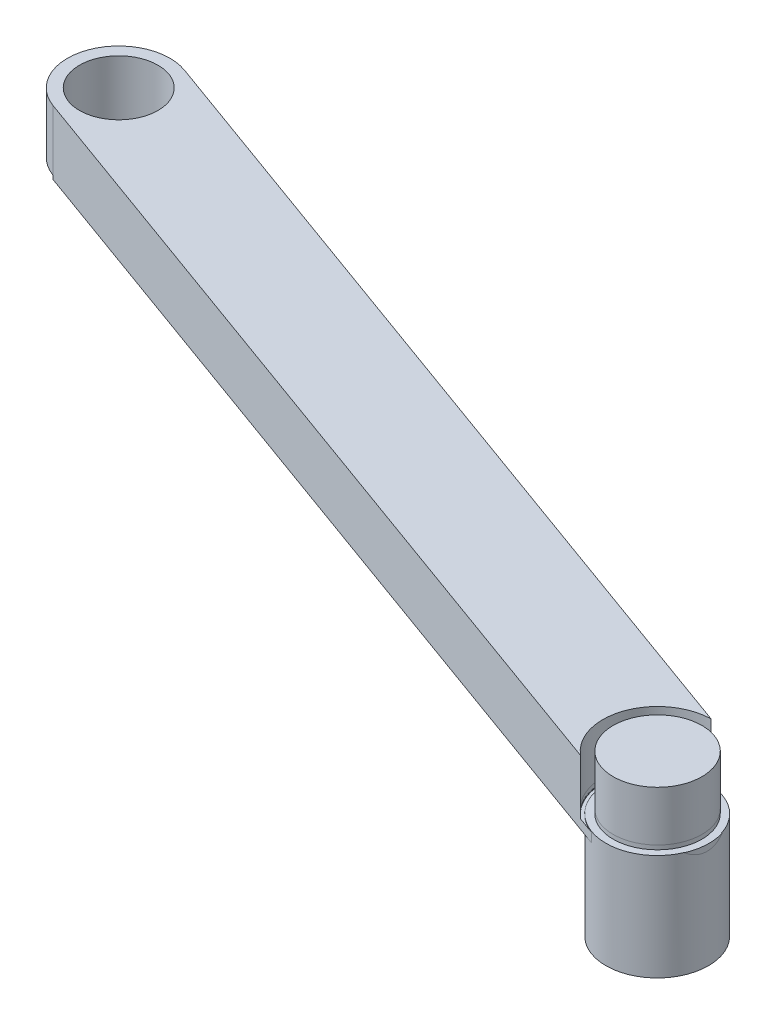
ISO-10303-21;
HEADER;
FILE_DESCRIPTION(('STEP AP214'),'2;1');
FILE_NAME('part.step','',(''),(''),'','','');
FILE_SCHEMA(('AUTOMOTIVE_DESIGN { 1 0 10303 214 1 1 1 1 }'));
ENDSEC;
DATA;
#1=APPLICATION_CONTEXT('core data for automotive mechanical design processes');
#2=APPLICATION_PROTOCOL_DEFINITION('international standard','automotive_design',2000,#1);
#3=PRODUCT_CONTEXT('',#1,'mechanical');
#4=PRODUCT('Part','Part','',(#3));
#5=PRODUCT_RELATED_PRODUCT_CATEGORY('part','',(#4));
#6=PRODUCT_DEFINITION_FORMATION('','',#4);
#7=PRODUCT_DEFINITION_CONTEXT('part definition',#1,'design');
#8=PRODUCT_DEFINITION('design','',#6,#7);
#9=PRODUCT_DEFINITION_SHAPE('','',#8);
#10=(LENGTH_UNIT() NAMED_UNIT(*) SI_UNIT(.MILLI.,.METRE.));
#11=(NAMED_UNIT(*) PLANE_ANGLE_UNIT() SI_UNIT($,.RADIAN.));
#12=(NAMED_UNIT(*) SI_UNIT($,.STERADIAN.) SOLID_ANGLE_UNIT());
#13=UNCERTAINTY_MEASURE_WITH_UNIT(LENGTH_MEASURE(1.E-05),#10,'distance_accuracy_value','');
#14=(GEOMETRIC_REPRESENTATION_CONTEXT(3) GLOBAL_UNCERTAINTY_ASSIGNED_CONTEXT((#13)) GLOBAL_UNIT_ASSIGNED_CONTEXT((#10,
#11,#12)) REPRESENTATION_CONTEXT('',''));
#15=CARTESIAN_POINT('',(0.,0.,0.));
#16=DIRECTION('',(0.,0.,1.));
#17=DIRECTION('',(1.,0.,0.));
#18=AXIS2_PLACEMENT_3D('',#15,#16,#17);
#19=CARTESIAN_POINT('',(85.8457251195717,56.3914355366213,55.1664235793516));
#20=DIRECTION('',(0.,-1.,0.));
#21=DIRECTION('',(0.0808490214511132,0.,-0.996726359504151));
#22=AXIS2_PLACEMENT_3D('',#19,#20,#21);
#23=CYLINDRICAL_SURFACE('',#22,3.46216045673487);
#24=CARTESIAN_POINT('',(85.8457251195717,52.7714355366213,55.1664235793516));
#25=DIRECTION('',(0.,1.,0.));
#26=DIRECTION('',(-0.0808490214511134,0.,0.996726359504151));
#27=AXIS2_PLACEMENT_3D('',#24,#25,#26);
#28=CIRCLE('',#27,3.46216045673486);
#29=CARTESIAN_POINT('',(85.5658128345379,52.7714355366213,58.6172501674122));
#30=VERTEX_POINT('',#29);
#31=EDGE_CURVE('E175',#30,#30,#28,.T.);
#32=ORIENTED_EDGE('',*,*,#31,.T.);
#33=EDGE_LOOP('',(#32));
#34=FACE_BOUND('',#33,.T.);
#35=CARTESIAN_POINT('',(85.8457251195717,56.6741982646804,55.1664235793516));
#36=DIRECTION('',(0.,1.,0.));
#37=DIRECTION('',(-1.,0.,0.));
#38=AXIS2_PLACEMENT_3D('',#35,#36,#37);
#39=CIRCLE('',#38,3.46216045673485);
#40=CARTESIAN_POINT('',(82.3835646628368,56.6741982646804,55.1664235793516));
#41=VERTEX_POINT('',#40);
#42=EDGE_CURVE('E337',#41,#41,#39,.T.);
#43=ORIENTED_EDGE('',*,*,#42,.F.);
#44=EDGE_LOOP('',(#43));
#45=FACE_BOUND('',#44,.T.);
#46=ADVANCED_FACE('F47',(#34,#45),#23,.T.);
#47=CARTESIAN_POINT('',(-3.49498099406498,44.1741982646804,22.8672179713954));
#48=DIRECTION('',(0.,1.,0.));
#49=DIRECTION('',(0.940352368567653,0.,0.340202032517745));
#50=AXIS2_PLACEMENT_3D('',#47,#48,#49);
#51=PLANE('',#50);
#52=CARTESIAN_POINT('',(85.8384940198621,44.1741982646804,55.1864110605812));
#53=DIRECTION('',(0.,1.,0.));
#54=DIRECTION('',(0.940352368567653,0.,0.340202032517745));
#55=AXIS2_PLACEMENT_3D('',#52,#53,#54);
#56=CIRCLE('',#55,4.);
#57=CARTESIAN_POINT('',(89.5999034941327,44.1741982646804,56.5472191906522));
#58=VERTEX_POINT('',#57);
#59=EDGE_CURVE('E411',#58,#58,#56,.T.);
#60=ORIENTED_EDGE('',*,*,#59,.F.);
#61=EDGE_LOOP('',(#60));
#62=FACE_BOUND('',#61,.T.);
#63=ADVANCED_FACE('F238',(#62),#51,.F.);
#64=CARTESIAN_POINT('',(85.8451387170718,57.4541363944661,55.1680444543817));
#65=DIRECTION('',(0.,1.,0.));
#66=DIRECTION('',(-0.0808490214511132,0.,0.996726359504151));
#67=AXIS2_PLACEMENT_3D('',#64,#65,#66);
#68=CYLINDRICAL_SURFACE('',#67,3.46388414573083);
#69=ORIENTED_EDGE('',*,*,#31,.F.);
#70=EDGE_LOOP('',(#69));
#71=FACE_BOUND('',#70,.T.);
#72=CARTESIAN_POINT('',(85.8451387170718,52.4498767005646,55.1680444543817));
#73=DIRECTION('',(0.,1.,0.));
#74=DIRECTION('',(-0.0808490214511132,0.,0.996726359504151));
#75=AXIS2_PLACEMENT_3D('',#72,#73,#74);
#76=CIRCLE('',#75,3.46388414573083);
#77=CARTESIAN_POINT('',(85.5650870734694,52.4498767005646,58.6205890887001));
#78=VERTEX_POINT('',#77);
#79=EDGE_CURVE('E164',#78,#78,#76,.T.);
#80=ORIENTED_EDGE('',*,*,#79,.T.);
#81=EDGE_LOOP('',(#80));
#82=FACE_BOUND('',#81,.T.);
#83=ADVANCED_FACE('F270',(#71,#82),#68,.T.);
#84=CARTESIAN_POINT('',(85.8451387170718,57.4541363944661,55.1680444543817));
#85=DIRECTION('',(0.,-1.,0.));
#86=DIRECTION('',(0.0808490214511132,0.,-0.996726359504151));
#87=AXIS2_PLACEMENT_3D('',#84,#85,#86);
#88=CYLINDRICAL_SURFACE('',#87,4.01953162113846);
#89=CARTESIAN_POINT('',(89.3687623921373,52.7701991631344,57.1021361403806));
#90=CARTESIAN_POINT('',(89.3908972797413,52.7221278434932,57.0618099325423));
#91=CARTESIAN_POINT('',(89.4132007691247,52.675809604025,57.0195330596799));
#92=CARTESIAN_POINT('',(89.4576859180895,52.5868622370854,56.9311635140443));
#93=CARTESIAN_POINT('',(89.4798675215307,52.54423469469,56.885069218234));
#94=CARTESIAN_POINT('',(89.545709618222,52.4218539904194,56.7408087204941));
#95=CARTESIAN_POINT('',(89.5884583328156,52.3480421194022,56.637031994895));
#96=CARTESIAN_POINT('',(89.6678090984182,52.2184792637632,56.416101875649));
#97=CARTESIAN_POINT('',(89.7043903916411,52.162788707717,56.2989054528141));
#98=CARTESIAN_POINT('',(89.7677313215756,52.0723734133498,56.0544682306541));
#99=CARTESIAN_POINT('',(89.7945180599111,52.0375906483577,55.9272563495601));
#100=CARTESIAN_POINT('',(89.8339290494133,51.9928439154911,55.6785323546795));
#101=CARTESIAN_POINT('',(89.8476113800621,51.9809271454762,55.5575384668752));
#102=CARTESIAN_POINT('',(89.8638501867552,51.9764334949343,55.3144076220675));
#103=CARTESIAN_POINT('',(89.8664046907054,51.9838600420932,55.1922704662953));
#104=CARTESIAN_POINT('',(89.8608264297183,52.016302765115,54.9594787300138));
#105=CARTESIAN_POINT('',(89.8534353082014,52.0400403586655,54.8486221742364));
#106=CARTESIAN_POINT('',(89.8302781322698,52.1025862904,54.6321781108256));
#107=CARTESIAN_POINT('',(89.8145098563547,52.1413986254534,54.5265920089693));
#108=CARTESIAN_POINT('',(89.7750126083237,52.2353934426093,54.316678578976));
#109=CARTESIAN_POINT('',(89.7508592583065,52.2914251653037,54.2128149725876));
#110=CARTESIAN_POINT('',(89.6971743724085,52.4170746399693,54.0152519701816));
#111=CARTESIAN_POINT('',(89.6676445795716,52.4866879892959,53.9215492956513));
#112=CARTESIAN_POINT('',(89.6234078729869,52.5948214358763,53.7958455509132));
#113=CARTESIAN_POINT('',(89.6098455165828,52.6284489267671,53.7591170535012));
#114=CARTESIAN_POINT('',(89.5824381533573,52.6977759093591,53.6879512136356));
#115=CARTESIAN_POINT('',(89.5685938330373,52.7334706862004,53.6535090144503));
#116=CARTESIAN_POINT('',(89.5546964119901,52.7701991631344,53.6202020330079));
#117=B_SPLINE_CURVE_WITH_KNOTS('',3,(#89,#90,#91,#92,#93,#94,#95,#96,#97,#98,#99,#100,#101,#102,
#103,#104,#105,#106,#107,#108,#109,#110,#111,#112,#113,#114,#115,#116),.UNSPECIFIED.,.F.,.F.,(4,
2,2,2,2,2,2,2,2,2,2,2,2,4),(0.,0.199496474361152,0.399078207551672,0.800049133333822,
1.20234377852682,1.60351669281897,1.96856565127002,2.33367930174428,2.67302106211816,
3.01245285597977,3.37244672636313,3.73232409379486,3.88708342006848,4.04150271496432),.UNSPECIFIED.);
#118=CARTESIAN_POINT('',(89.5310775562295,52.4498767005646,56.7713190183042));
#119=VERTEX_POINT('',#118);
#120=CARTESIAN_POINT('',(89.6834180163914,52.4498767005646,53.9746264749013));
#121=VERTEX_POINT('',#120);
#122=EDGE_CURVE('E159',#119,#121,#117,.T.);
#123=ORIENTED_EDGE('',*,*,#122,.T.);
#124=CARTESIAN_POINT('',(85.8451387170718,52.4498767005646,55.1680444543817));
#125=DIRECTION('',(0.,1.,0.));
#126=DIRECTION('',(-0.0808490214511132,0.,0.996726359504151));
#127=AXIS2_PLACEMENT_3D('',#124,#125,#126);
#128=CIRCLE('',#127,4.01953162113846);
#129=EDGE_CURVE('E264',#119,#121,#128,.T.);
#130=ORIENTED_EDGE('',*,*,#129,.F.);
#131=EDGE_LOOP('',(#123,#130));
#132=FACE_BOUND('',#131,.T.);
#133=ADVANCED_FACE('F246',(#132),#88,.T.);
#134=CARTESIAN_POINT('',(137.793468633073,54.2919383485024,59.2815769143767));
#135=DIRECTION('',(-0.996726359504151,0.,-0.0808490214511132));
#136=DIRECTION('',(-0.0808490214511132,0.,0.996726359504151));
#137=AXIS2_PLACEMENT_3D('',#134,#135,#136);
#138=CYLINDRICAL_SURFACE('',#137,2.31365217276674);
#139=CARTESIAN_POINT('',(89.6496530121158,52.4498767005646,53.9718876413901));
#140=CARTESIAN_POINT('',(89.6653631787691,52.4135070230865,54.0211841254028));
#141=CARTESIAN_POINT('',(89.6804871867506,52.3789158246488,54.0719552803588));
#142=CARTESIAN_POINT('',(89.7092342510237,52.3134859277548,54.176309584074));
#143=CARTESIAN_POINT('',(89.7228563527116,52.2826496145982,54.2298944896637));
#144=CARTESIAN_POINT('',(89.7610384055684,52.1959253819902,54.3949613146068));
#145=CARTESIAN_POINT('',(89.7827962835681,52.1460867858057,54.5103986824794));
#146=CARTESIAN_POINT('',(89.8163963096267,52.0645945323088,54.7494655602995));
#147=CARTESIAN_POINT('',(89.8281970810243,52.0330169275748,54.8731269732005));
#148=CARTESIAN_POINT('',(89.839975078335,51.9902526228352,55.1242265026417));
#149=CARTESIAN_POINT('',(89.8399840303508,51.9790112892078,55.2516535626972));
#150=CARTESIAN_POINT('',(89.8282602540738,51.9776869189448,55.495246361383));
#151=CARTESIAN_POINT('',(89.8175189940947,51.9858973216263,55.6114543800793));
#152=CARTESIAN_POINT('',(89.7864080638322,52.0197015861571,55.8400881900363));
#153=CARTESIAN_POINT('',(89.7660291668857,52.0453121164281,55.9525102460595));
#154=CARTESIAN_POINT('',(89.7177078507057,52.1120710291253,56.1680747290894));
#155=CARTESIAN_POINT('',(89.6899377930309,52.1528728671971,56.2713648723882));
#156=CARTESIAN_POINT('',(89.6286436203477,52.2485447843303,56.4691672721439));
#157=CARTESIAN_POINT('',(89.5951266465742,52.3033974448444,56.5636902009457));
#158=CARTESIAN_POINT('',(89.5441520630618,52.3917389999653,56.6930510885066));
#159=CARTESIAN_POINT('',(89.5280876462384,52.4202223061093,56.7319371138451));
#160=CARTESIAN_POINT('',(89.5117794971903,52.4498767005646,56.7697536647101));
#161=B_SPLINE_CURVE_WITH_KNOTS('',3,(#139,#140,#141,#142,#143,#144,#145,#146,#147,#148,#149,
#150,#151,#152,#153,#154,#155,#156,#157,#158,#159,#160),.UNSPECIFIED.,.F.,.F.,(4,2,2,2,2,2,2,2,
2,2,4),(0.,0.189639969590802,0.379399786803515,0.760282346211737,1.14273997183633,
1.5241685862148,1.87338726773213,2.22294095523212,2.56496575076365,2.906568579267,
3.05887183267354),.UNSPECIFIED.);
#162=CARTESIAN_POINT('',(89.6496530121158,52.4498767005646,53.9718876413901));
#163=VERTEX_POINT('',#162);
#164=CARTESIAN_POINT('',(89.5117794971903,52.4498767005646,56.7697536647101));
#165=VERTEX_POINT('',#164);
#166=EDGE_CURVE('E157',#163,#165,#161,.T.);
#167=ORIENTED_EDGE('',*,*,#166,.F.);
#168=DIRECTION('',(-0.996726359504151,0.,-0.0808490214511132));
#169=VECTOR('',#168,1.);
#170=CARTESIAN_POINT('',(137.906651351205,52.4498767005646,57.8862328944084));
#171=LINE('',#170,#169);
#172=EDGE_CURVE('E165',#121,#163,#171,.T.);
#173=ORIENTED_EDGE('',*,*,#172,.F.);
#174=ORIENTED_EDGE('',*,*,#122,.F.);
#175=DIRECTION('',(-0.996726359504151,0.,-0.0808490214511132));
#176=VECTOR('',#175,1.);
#177=CARTESIAN_POINT('',(137.680285914942,52.4498767005646,60.6769209343449));
#178=LINE('',#177,#176);
#179=EDGE_CURVE('E153',#165,#119,#178,.F.);
#180=ORIENTED_EDGE('',*,*,#179,.F.);
#181=EDGE_LOOP('',(#167,#173,#174,#180));
#182=FACE_BOUND('',#181,.T.);
#183=ADVANCED_FACE('F155',(#182),#138,.T.);
#184=CARTESIAN_POINT('',(20.0138282201264,56.8890920513352,31.3722687843391));
#185=DIRECTION('',(0.,1.,0.));
#186=DIRECTION('',(-0.0808490214511132,0.,0.996726359504151));
#187=AXIS2_PLACEMENT_3D('',#184,#185,#186);
#188=CYLINDRICAL_SURFACE('',#187,3.06284499681519);
#189=CARTESIAN_POINT('',(20.0138282201264,56.6741982646804,31.3722687843391));
#190=DIRECTION('',(0.,1.,0.));
#191=DIRECTION('',(-0.996726359504151,0.,-0.0808490214511132));
#192=AXIS2_PLACEMENT_3D('',#189,#190,#191);
#193=CIRCLE('',#192,3.06284499681519);
#194=CARTESIAN_POINT('',(16.9610098767253,56.6741982646804,31.1246407634901));
#195=VERTEX_POINT('',#194);
#196=EDGE_CURVE('E203',#195,#195,#193,.T.);
#197=ORIENTED_EDGE('',*,*,#196,.T.);
#198=EDGE_LOOP('',(#197));
#199=FACE_BOUND('',#198,.T.);
#200=CARTESIAN_POINT('',(20.0138282201264,51.9649659412137,31.3722687843391));
#201=DIRECTION('',(0.,1.,0.));
#202=DIRECTION('',(-0.0808490214511132,0.,0.996726359504151));
#203=AXIS2_PLACEMENT_3D('',#200,#201,#202);
#204=CIRCLE('',#203,3.06284499681519);
#205=CARTESIAN_POINT('',(19.7662001992774,51.9649659412137,34.4250871277402));
#206=VERTEX_POINT('',#205);
#207=EDGE_CURVE('E56',#206,#206,#204,.T.);
#208=ORIENTED_EDGE('',*,*,#207,.F.);
#209=EDGE_LOOP('',(#208));
#210=FACE_BOUND('',#209,.T.);
#211=ADVANCED_FACE('F241',(#199,#210),#188,.F.);
#212=CARTESIAN_POINT('',(88.144274755023,52.3835128318238,51.8709839556456));
#213=DIRECTION('',(0.,1.,0.));
#214=DIRECTION('',(-0.0808490214511132,0.,0.996726359504151));
#215=AXIS2_PLACEMENT_3D('',#212,#213,#214);
#216=PLANE('',#215);
#217=DIRECTION('',(0.940352368567653,0.,0.340202032517745));
#218=VECTOR('',#217,1.);
#219=CARTESIAN_POINT('',(-4.85578912413596,52.3835128318238,26.628627445666));
#220=LINE('',#219,#218);
#221=CARTESIAN_POINT('',(83.1328269746314,52.3835128318238,58.4612755420595));
#222=VERTEX_POINT('',#221);
#223=CARTESIAN_POINT('',(84.4776858897912,52.3835128318238,58.9478205348518));
#224=VERTEX_POINT('',#223);
#225=EDGE_CURVE('E222',#222,#224,#220,.T.);
#226=ORIENTED_EDGE('',*,*,#225,.T.);
#227=CARTESIAN_POINT('',(85.8451387170718,52.3835128318238,55.1680444543817));
#228=DIRECTION('',(0.,1.,0.));
#229=DIRECTION('',(-0.0808490214511132,0.,0.996726359504151));
#230=AXIS2_PLACEMENT_3D('',#227,#228,#229);
#231=CIRCLE('',#230,4.01953162113844);
#232=CARTESIAN_POINT('',(86.6736242007322,52.3835128318238,51.2348210617054));
#233=VERTEX_POINT('',#232);
#234=EDGE_CURVE('E383',#233,#224,#231,.T.);
#235=ORIENTED_EDGE('',*,*,#234,.F.);
#236=DIRECTION('',(0.940352368567653,0.,0.340202032517745));
#237=VECTOR('',#236,1.);
#238=CARTESIAN_POINT('',(-2.134172863994,52.3835128318238,19.1058084971248));
#239=LINE('',#238,#237);
#240=CARTESIAN_POINT('',(85.7553551952423,52.3835128318238,50.902608380047));
#241=VERTEX_POINT('',#240);
#242=EDGE_CURVE('E400',#241,#233,#239,.T.);
#243=ORIENTED_EDGE('',*,*,#242,.F.);
#244=CARTESIAN_POINT('',(85.8451387170718,52.3835128318238,55.1680444543817));
#245=DIRECTION('',(0.,1.,0.));
#246=DIRECTION('',(-0.0808490214511132,0.,0.996726359504151));
#247=AXIS2_PLACEMENT_3D('',#244,#245,#246);
#248=CIRCLE('',#247,4.26638090013398);
#249=EDGE_CURVE('E386',#241,#222,#248,.T.);
#250=ORIENTED_EDGE('',*,*,#249,.T.);
#251=EDGE_LOOP('',(#226,#235,#243,#250));
#252=FACE_BOUND('',#251,.T.);
#253=ADVANCED_FACE('F293',(#252),#216,.T.);
#254=CARTESIAN_POINT('',(85.8451387170718,57.4541363944661,55.1680444543817));
#255=DIRECTION('',(0.,1.,0.));
#256=DIRECTION('',(-0.0808490214511132,0.,0.996726359504151));
#257=AXIS2_PLACEMENT_3D('',#254,#255,#256);
#258=CYLINDRICAL_SURFACE('',#257,4.26638090013398);
#259=DIRECTION('',(0.,1.,0.));
#260=VECTOR('',#259,1.);
#261=CARTESIAN_POINT('',(85.7553551952423,57.4541363944661,50.902608380047));
#262=LINE('',#261,#260);
#263=CARTESIAN_POINT('',(85.7553551952423,52.4498767005646,50.902608380047));
#264=VERTEX_POINT('',#263);
#265=EDGE_CURVE('E371',#264,#241,#262,.F.);
#266=ORIENTED_EDGE('',*,*,#265,.F.);
#267=CARTESIAN_POINT('',(85.8451387170718,52.4498767005646,55.1680444543817));
#268=DIRECTION('',(0.,1.,0.));
#269=DIRECTION('',(-0.0808490214511132,0.,0.996726359504151));
#270=AXIS2_PLACEMENT_3D('',#267,#268,#269);
#271=CIRCLE('',#270,4.26638090013398);
#272=CARTESIAN_POINT('',(83.1328269746314,52.4498767005646,58.4612755420595));
#273=VERTEX_POINT('',#272);
#274=EDGE_CURVE('E181',#264,#273,#271,.T.);
#275=ORIENTED_EDGE('',*,*,#274,.T.);
#276=DIRECTION('',(0.,1.,0.));
#277=VECTOR('',#276,1.);
#278=CARTESIAN_POINT('',(83.1328269746314,57.4541363944661,58.4612755420595));
#279=LINE('',#278,#277);
#280=EDGE_CURVE('E369',#273,#222,#279,.F.);
#281=ORIENTED_EDGE('',*,*,#280,.T.);
#282=ORIENTED_EDGE('',*,*,#249,.F.);
#283=EDGE_LOOP('',(#266,#275,#281,#282));
#284=FACE_BOUND('',#283,.T.);
#285=ADVANCED_FACE('F296',(#284),#258,.F.);
#286=CARTESIAN_POINT('',(95.2843481729344,52.4498767005646,29.077127526178));
#287=DIRECTION('',(0.,1.,0.));
#288=DIRECTION('',(-0.0808490214511132,0.,0.996726359504151));
#289=AXIS2_PLACEMENT_3D('',#286,#287,#288);
#290=PLANE('',#289);
#291=DIRECTION('',(0.940352368567653,0.,0.340202032517745));
#292=VECTOR('',#291,1.);
#293=CARTESIAN_POINT('',(-4.85578912413596,52.4498767005646,26.628627445666));
#294=LINE('',#293,#292);
#295=CARTESIAN_POINT('',(83.1003136411073,52.4498767005646,58.4495128214895));
#296=VERTEX_POINT('',#295);
#297=EDGE_CURVE('E361',#296,#273,#294,.T.);
#298=ORIENTED_EDGE('',*,*,#297,.T.);
#299=ORIENTED_EDGE('',*,*,#274,.F.);
#300=DIRECTION('',(0.940352368567653,0.,0.340202032517745));
#301=VECTOR('',#300,1.);
#302=CARTESIAN_POINT('',(-2.134172863994,52.4498767005646,19.1058084971248));
#303=LINE('',#302,#301);
#304=CARTESIAN_POINT('',(85.7250255077385,52.4498767005646,50.8916356620752));
#305=VERTEX_POINT('',#304);
#306=EDGE_CURVE('E185',#305,#264,#303,.T.);
#307=ORIENTED_EDGE('',*,*,#306,.F.);
#308=CARTESIAN_POINT('',(85.8451387170718,52.4498767005646,55.1680444543817));
#309=DIRECTION('',(0.,1.,0.));
#310=DIRECTION('',(-0.0808490214511132,0.,0.996726359504151));
#311=AXIS2_PLACEMENT_3D('',#308,#309,#310);
#312=CIRCLE('',#311,4.27809529369937);
#313=EDGE_CURVE('E197',#305,#296,#312,.T.);
#314=ORIENTED_EDGE('',*,*,#313,.T.);
#315=EDGE_LOOP('',(#298,#299,#307,#314));
#316=FACE_BOUND('',#315,.T.);
#317=ADVANCED_FACE('F305',(#316),#290,.T.);
#318=CARTESIAN_POINT('',(85.8451387170718,57.4541363944661,55.1680444543817));
#319=DIRECTION('',(0.,1.,0.));
#320=DIRECTION('',(-0.0808490214511132,0.,0.996726359504151));
#321=AXIS2_PLACEMENT_3D('',#318,#319,#320);
#322=CYLINDRICAL_SURFACE('',#321,4.27809529369937);
#323=DIRECTION('',(0.,1.,0.));
#324=VECTOR('',#323,1.);
#325=CARTESIAN_POINT('',(83.1003136411073,57.4541363944661,58.4495128214895));
#326=LINE('',#325,#324);
#327=CARTESIAN_POINT('',(83.1003136411073,52.7701991631344,58.4495128214895));
#328=VERTEX_POINT('',#327);
#329=EDGE_CURVE('E366',#328,#296,#326,.F.);
#330=ORIENTED_EDGE('',*,*,#329,.T.);
#331=ORIENTED_EDGE('',*,*,#313,.F.);
#332=DIRECTION('',(0.,1.,0.));
#333=VECTOR('',#332,1.);
#334=CARTESIAN_POINT('',(85.7250255077385,57.4541363944661,50.8916356620752));
#335=LINE('',#334,#333);
#336=CARTESIAN_POINT('',(85.7250255077385,52.7701991631344,50.8916356620752));
#337=VERTEX_POINT('',#336);
#338=EDGE_CURVE('E437',#337,#305,#335,.F.);
#339=ORIENTED_EDGE('',*,*,#338,.F.);
#340=CARTESIAN_POINT('',(85.8451387170718,52.7701991631344,55.1680444543817));
#341=DIRECTION('',(0.,1.,0.));
#342=DIRECTION('',(-0.0808490214511132,0.,0.996726359504151));
#343=AXIS2_PLACEMENT_3D('',#340,#341,#342);
#344=CIRCLE('',#343,4.27809529369937);
#345=EDGE_CURVE('E200',#337,#328,#344,.T.);
#346=ORIENTED_EDGE('',*,*,#345,.T.);
#347=EDGE_LOOP('',(#330,#331,#339,#346));
#348=FACE_BOUND('',#347,.T.);
#349=ADVANCED_FACE('F302',(#348),#322,.F.);
#350=CARTESIAN_POINT('',(95.2843481729344,52.7701991631344,29.077127526178));
#351=DIRECTION('',(0.,1.,0.));
#352=DIRECTION('',(-0.0808490214511132,0.,0.996726359504151));
#353=AXIS2_PLACEMENT_3D('',#350,#351,#352);
#354=PLANE('',#353);
#355=ORIENTED_EDGE('',*,*,#345,.F.);
#356=DIRECTION('',(0.940352368567653,0.,0.340202032517745));
#357=VECTOR('',#356,1.);
#358=CARTESIAN_POINT('',(-2.134172863994,52.7701991631345,19.1058084971248));
#359=LINE('',#358,#357);
#360=CARTESIAN_POINT('',(85.7553551952423,52.7701991631344,50.902608380047));
#361=VERTEX_POINT('',#360);
#362=EDGE_CURVE('E194',#337,#361,#359,.T.);
#363=ORIENTED_EDGE('',*,*,#362,.T.);
#364=CARTESIAN_POINT('',(85.8451387170718,52.7701991631344,55.1680444543817));
#365=DIRECTION('',(0.,1.,0.));
#366=DIRECTION('',(-0.0808490214511132,0.,0.996726359504151));
#367=AXIS2_PLACEMENT_3D('',#364,#365,#366);
#368=CIRCLE('',#367,4.26638090013398);
#369=CARTESIAN_POINT('',(83.1328269746314,52.7701991631344,58.4612755420595));
#370=VERTEX_POINT('',#369);
#371=EDGE_CURVE('E195',#361,#370,#368,.T.);
#372=ORIENTED_EDGE('',*,*,#371,.T.);
#373=DIRECTION('',(0.940352368567653,0.,0.340202032517745));
#374=VECTOR('',#373,1.);
#375=CARTESIAN_POINT('',(-4.85578912413596,52.7701991631345,26.628627445666));
#376=LINE('',#375,#374);
#377=EDGE_CURVE('E191',#328,#370,#376,.T.);
#378=ORIENTED_EDGE('',*,*,#377,.F.);
#379=EDGE_LOOP('',(#355,#363,#372,#378));
#380=FACE_BOUND('',#379,.T.);
#381=ADVANCED_FACE('F49',(#380),#354,.F.);
#382=ORIENTED_EDGE('',*,*,#371,.F.);
#383=CARTESIAN_POINT('',(85.7553551952423,56.6741982646804,50.902608380047));
#384=VERTEX_POINT('',#383);
#385=EDGE_CURVE('E375',#384,#361,#262,.F.);
#386=ORIENTED_EDGE('',*,*,#385,.F.);
#387=CARTESIAN_POINT('',(85.8451387170718,56.6741982646804,55.1680444543817));
#388=DIRECTION('',(0.,1.,0.));
#389=DIRECTION('',(-0.996726359504151,0.,-0.0808490214511132));
#390=AXIS2_PLACEMENT_3D('',#387,#388,#389);
#391=CIRCLE('',#390,4.26638090013398);
#392=CARTESIAN_POINT('',(83.1328269746314,56.6741982646804,58.4612755420595));
#393=VERTEX_POINT('',#392);
#394=EDGE_CURVE('E396',#393,#384,#391,.F.);
#395=ORIENTED_EDGE('',*,*,#394,.F.);
#396=EDGE_CURVE('E221',#393,#370,#279,.F.);
#397=ORIENTED_EDGE('',*,*,#396,.T.);
#398=EDGE_LOOP('',(#382,#386,#395,#397));
#399=FACE_BOUND('',#398,.T.);
#400=ADVANCED_FACE('F298',(#399),#258,.F.);
#401=CARTESIAN_POINT('',(-3.49498099406498,56.6741982646804,22.8672179713954));
#402=DIRECTION('',(0.,1.,0.));
#403=DIRECTION('',(0.940352368567653,0.,0.340202032517745));
#404=AXIS2_PLACEMENT_3D('',#401,#402,#403);
#405=PLANE('',#404);
#406=ORIENTED_EDGE('',*,*,#196,.F.);
#407=EDGE_LOOP('',(#406));
#408=FACE_BOUND('',#407,.T.);
#409=DIRECTION('',(0.940352368567653,0.,0.340202032517745));
#410=VECTOR('',#409,1.);
#411=CARTESIAN_POINT('',(-4.85578912413596,56.6741982646804,26.628627445666));
#412=LINE('',#411,#410);
#413=CARTESIAN_POINT('',(18.6530200900554,56.6741982646804,35.1336782586097));
#414=VERTEX_POINT('',#413);
#415=EDGE_CURVE('E217',#414,#393,#412,.T.);
#416=ORIENTED_EDGE('',*,*,#415,.T.);
#417=ORIENTED_EDGE('',*,*,#394,.T.);
#418=DIRECTION('',(0.940352368567653,0.,0.340202032517745));
#419=VECTOR('',#418,1.);
#420=CARTESIAN_POINT('',(-2.134172863994,56.6741982646804,19.1058084971248));
#421=LINE('',#420,#419);
#422=CARTESIAN_POINT('',(21.3746363501973,56.6741982646804,27.6108593100684));
#423=VERTEX_POINT('',#422);
#424=EDGE_CURVE('E214',#423,#384,#421,.T.);
#425=ORIENTED_EDGE('',*,*,#424,.F.);
#426=CARTESIAN_POINT('',(20.0138282201263,56.6741982646804,31.372268784339));
#427=DIRECTION('',(0.,1.,0.));
#428=DIRECTION('',(0.940352368567653,0.,0.340202032517745));
#429=AXIS2_PLACEMENT_3D('',#426,#427,#428);
#430=CIRCLE('',#429,4.);
#431=EDGE_CURVE('E218',#423,#414,#430,.T.);
#432=ORIENTED_EDGE('',*,*,#431,.T.);
#433=EDGE_LOOP('',(#416,#417,#425,#432));
#434=FACE_BOUND('',#433,.T.);
#435=ADVANCED_FACE('F283',(#408,#434),#405,.T.);
#436=CARTESIAN_POINT('',(20.0138282201263,56.6741982646804,31.372268784339));
#437=DIRECTION('',(0.,-1.,0.));
#438=DIRECTION('',(-0.940352368567653,0.,-0.340202032517745));
#439=AXIS2_PLACEMENT_3D('',#436,#437,#438);
#440=CYLINDRICAL_SURFACE('',#439,4.);
#441=DIRECTION('',(0.,-1.,0.));
#442=VECTOR('',#441,1.);
#443=CARTESIAN_POINT('',(21.3746363501973,56.6741982646804,27.6108593100684));
#444=LINE('',#443,#442);
#445=CARTESIAN_POINT('',(21.3746363501973,51.9649659412137,27.6108593100684));
#446=VERTEX_POINT('',#445);
#447=EDGE_CURVE('E418',#423,#446,#444,.T.);
#448=ORIENTED_EDGE('',*,*,#447,.T.);
#449=CARTESIAN_POINT('',(20.0138282201264,51.9649659412137,31.3722687843391));
#450=DIRECTION('',(0.,1.,0.));
#451=DIRECTION('',(-0.0808490214511132,0.,0.996726359504151));
#452=AXIS2_PLACEMENT_3D('',#449,#450,#451);
#453=CIRCLE('',#452,4.);
#454=CARTESIAN_POINT('',(18.6530200900554,51.9649659412137,35.1336782586097));
#455=VERTEX_POINT('',#454);
#456=EDGE_CURVE('E209',#446,#455,#453,.T.);
#457=ORIENTED_EDGE('',*,*,#456,.T.);
#458=DIRECTION('',(0.,-1.,0.));
#459=VECTOR('',#458,1.);
#460=CARTESIAN_POINT('',(18.6530200900554,56.6741982646804,35.1336782586097));
#461=LINE('',#460,#459);
#462=EDGE_CURVE('E427',#414,#455,#461,.T.);
#463=ORIENTED_EDGE('',*,*,#462,.F.);
#464=ORIENTED_EDGE('',*,*,#431,.F.);
#465=EDGE_LOOP('',(#448,#457,#463,#464));
#466=FACE_BOUND('',#465,.T.);
#467=ADVANCED_FACE('F280',(#466),#440,.T.);
#468=CARTESIAN_POINT('',(85.8384940198621,56.6741982646804,55.1864110605812));
#469=DIRECTION('',(0.,-1.,0.));
#470=DIRECTION('',(-0.940352368567653,0.,-0.340202032517745));
#471=AXIS2_PLACEMENT_3D('',#468,#469,#470);
#472=CYLINDRICAL_SURFACE('',#471,4.);
#473=ORIENTED_EDGE('',*,*,#59,.T.);
#474=EDGE_LOOP('',(#473));
#475=FACE_BOUND('',#474,.T.);
#476=CARTESIAN_POINT('',(85.8384940198621,52.4498767005646,55.1864110605812));
#477=DIRECTION('',(0.,1.,0.));
#478=DIRECTION('',(-0.0808490214511132,0.,0.996726359504151));
#479=AXIS2_PLACEMENT_3D('',#476,#477,#478);
#480=CIRCLE('',#479,4.);
#481=CARTESIAN_POINT('',(87.1993021499331,52.4498767005646,51.4250015863106));
#482=VERTEX_POINT('',#481);
#483=EDGE_CURVE('E174',#163,#482,#480,.T.);
#484=ORIENTED_EDGE('',*,*,#483,.F.);
#485=ORIENTED_EDGE('',*,*,#166,.T.);
#486=CARTESIAN_POINT('',(84.4776858897911,52.4498767005646,58.9478205348518));
#487=VERTEX_POINT('',#486);
#488=EDGE_CURVE('E171',#487,#165,#480,.T.);
#489=ORIENTED_EDGE('',*,*,#488,.F.);
#490=DIRECTION('',(0.,-1.,0.));
#491=VECTOR('',#490,1.);
#492=CARTESIAN_POINT('',(84.4776858897911,56.6741982646804,58.9478205348518));
#493=LINE('',#492,#491);
#494=EDGE_CURVE('E399',#487,#224,#493,.T.);
#495=ORIENTED_EDGE('',*,*,#494,.T.);
#496=CARTESIAN_POINT('',(84.4776858897911,51.6741982646804,58.9478205348518));
#497=VERTEX_POINT('',#496);
#498=EDGE_CURVE('E402',#224,#497,#493,.T.);
#499=ORIENTED_EDGE('',*,*,#498,.T.);
#500=CARTESIAN_POINT('',(85.8384940198621,51.6741982646804,55.1864110605812));
#501=DIRECTION('',(0.,1.,0.));
#502=DIRECTION('',(0.940352368567653,0.,0.340202032517745));
#503=AXIS2_PLACEMENT_3D('',#500,#501,#502);
#504=CIRCLE('',#503,4.);
#505=CARTESIAN_POINT('',(87.1993021499331,51.6741982646804,51.4250015863106));
#506=VERTEX_POINT('',#505);
#507=EDGE_CURVE('E421',#506,#497,#504,.T.);
#508=ORIENTED_EDGE('',*,*,#507,.F.);
#509=DIRECTION('',(0.,-1.,0.));
#510=VECTOR('',#509,1.);
#511=CARTESIAN_POINT('',(87.1993021499331,56.6741982646804,51.4250015863106));
#512=LINE('',#511,#510);
#513=EDGE_CURVE('E431',#482,#506,#512,.T.);
#514=ORIENTED_EDGE('',*,*,#513,.F.);
#515=EDGE_LOOP('',(#484,#485,#489,#495,#499,#508,#514));
#516=FACE_BOUND('',#515,.T.);
#517=ADVANCED_FACE('F170',(#475,#516),#472,.T.);
#518=ORIENTED_EDGE('',*,*,#488,.T.);
#519=ORIENTED_EDGE('',*,*,#179,.T.);
#520=ORIENTED_EDGE('',*,*,#129,.T.);
#521=ORIENTED_EDGE('',*,*,#172,.T.);
#522=ORIENTED_EDGE('',*,*,#483,.T.);
#523=CARTESIAN_POINT('',(86.6736242007322,52.4498767005646,51.2348210617054));
#524=VERTEX_POINT('',#523);
#525=EDGE_CURVE('E183',#524,#482,#303,.T.);
#526=ORIENTED_EDGE('',*,*,#525,.F.);
#527=CARTESIAN_POINT('',(85.8451387170718,52.4498767005646,55.1680444543817));
#528=DIRECTION('',(0.,1.,0.));
#529=DIRECTION('',(-0.0808490214511132,0.,0.996726359504151));
#530=AXIS2_PLACEMENT_3D('',#527,#528,#529);
#531=CIRCLE('',#530,4.01953162113844);
#532=EDGE_CURVE('E180',#524,#487,#531,.T.);
#533=ORIENTED_EDGE('',*,*,#532,.T.);
#534=EDGE_LOOP('',(#518,#519,#520,#521,#522,#526,#533));
#535=FACE_BOUND('',#534,.T.);
#536=ORIENTED_EDGE('',*,*,#79,.F.);
#537=EDGE_LOOP('',(#536));
#538=FACE_BOUND('',#537,.T.);
#539=ADVANCED_FACE('F177',(#535,#538),#290,.T.);
#540=CARTESIAN_POINT('',(85.8451387170718,57.4541363944661,55.1680444543817));
#541=DIRECTION('',(0.,1.,0.));
#542=DIRECTION('',(-0.0808490214511132,0.,0.996726359504151));
#543=AXIS2_PLACEMENT_3D('',#540,#541,#542);
#544=CYLINDRICAL_SURFACE('',#543,4.01953162113844);
#545=ORIENTED_EDGE('',*,*,#532,.F.);
#546=DIRECTION('',(0.,1.,0.));
#547=VECTOR('',#546,1.);
#548=CARTESIAN_POINT('',(86.6736242007322,57.4541363944661,51.2348210617054));
#549=LINE('',#548,#547);
#550=EDGE_CURVE('E219',#524,#233,#549,.F.);
#551=ORIENTED_EDGE('',*,*,#550,.T.);
#552=ORIENTED_EDGE('',*,*,#234,.T.);
#553=ORIENTED_EDGE('',*,*,#494,.F.);
#554=EDGE_LOOP('',(#545,#551,#552,#553));
#555=FACE_BOUND('',#554,.T.);
#556=ADVANCED_FACE('F278',(#555),#544,.T.);
#557=CARTESIAN_POINT('',(-4.85578912413596,56.6741982646804,26.628627445666));
#558=DIRECTION('',(0.340202032517745,0.,-0.940352368567653));
#559=DIRECTION('',(-0.940352368567653,0.,-0.340202032517745));
#560=AXIS2_PLACEMENT_3D('',#557,#558,#559);
#561=PLANE('',#560);
#562=ORIENTED_EDGE('',*,*,#297,.F.);
#563=ORIENTED_EDGE('',*,*,#329,.F.);
#564=ORIENTED_EDGE('',*,*,#377,.T.);
#565=ORIENTED_EDGE('',*,*,#396,.F.);
#566=ORIENTED_EDGE('',*,*,#415,.F.);
#567=ORIENTED_EDGE('',*,*,#462,.T.);
#568=DIRECTION('',(0.,1.,0.));
#569=VECTOR('',#568,1.);
#570=CARTESIAN_POINT('',(18.6530200900554,56.8890920513352,35.1336782586097));
#571=LINE('',#570,#569);
#572=CARTESIAN_POINT('',(18.6530200900554,51.6741982646804,35.1336782586097));
#573=VERTEX_POINT('',#572);
#574=EDGE_CURVE('E204',#455,#573,#571,.F.);
#575=ORIENTED_EDGE('',*,*,#574,.T.);
#576=DIRECTION('',(0.940352368567653,0.,0.340202032517745));
#577=VECTOR('',#576,1.);
#578=CARTESIAN_POINT('',(-4.85578912413596,51.6741982646804,26.628627445666));
#579=LINE('',#578,#577);
#580=EDGE_CURVE('E408',#573,#497,#579,.T.);
#581=ORIENTED_EDGE('',*,*,#580,.T.);
#582=ORIENTED_EDGE('',*,*,#498,.F.);
#583=ORIENTED_EDGE('',*,*,#225,.F.);
#584=ORIENTED_EDGE('',*,*,#280,.F.);
#585=EDGE_LOOP('',(#562,#563,#564,#565,#566,#567,#575,#581,#582,#583,#584));
#586=FACE_BOUND('',#585,.T.);
#587=ADVANCED_FACE('F274',(#586),#561,.F.);
#588=CARTESIAN_POINT('',(-2.134172863994,56.6741982646804,19.1058084971248));
#589=DIRECTION('',(0.340202032517745,0.,-0.940352368567653));
#590=DIRECTION('',(-0.940352368567653,0.,-0.340202032517745));
#591=AXIS2_PLACEMENT_3D('',#588,#589,#590);
#592=PLANE('',#591);
#593=ORIENTED_EDGE('',*,*,#550,.F.);
#594=ORIENTED_EDGE('',*,*,#525,.T.);
#595=ORIENTED_EDGE('',*,*,#513,.T.);
#596=DIRECTION('',(0.940352368567653,0.,0.340202032517745));
#597=VECTOR('',#596,1.);
#598=CARTESIAN_POINT('',(-2.134172863994,51.6741982646804,19.1058084971248));
#599=LINE('',#598,#597);
#600=CARTESIAN_POINT('',(21.3746363501973,51.6741982646804,27.6108593100684));
#601=VERTEX_POINT('',#600);
#602=EDGE_CURVE('E64',#601,#506,#599,.T.);
#603=ORIENTED_EDGE('',*,*,#602,.F.);
#604=DIRECTION('',(0.,1.,0.));
#605=VECTOR('',#604,1.);
#606=CARTESIAN_POINT('',(21.3746363501973,56.8890920513352,27.6108593100684));
#607=LINE('',#606,#605);
#608=EDGE_CURVE('E207',#446,#601,#607,.F.);
#609=ORIENTED_EDGE('',*,*,#608,.F.);
#610=ORIENTED_EDGE('',*,*,#447,.F.);
#611=ORIENTED_EDGE('',*,*,#424,.T.);
#612=ORIENTED_EDGE('',*,*,#385,.T.);
#613=ORIENTED_EDGE('',*,*,#362,.F.);
#614=ORIENTED_EDGE('',*,*,#338,.T.);
#615=ORIENTED_EDGE('',*,*,#306,.T.);
#616=ORIENTED_EDGE('',*,*,#265,.T.);
#617=ORIENTED_EDGE('',*,*,#242,.T.);
#618=EDGE_LOOP('',(#593,#594,#595,#603,#609,#610,#611,#612,#613,#614,#615,#616,#617));
#619=FACE_BOUND('',#618,.T.);
#620=ADVANCED_FACE('F277',(#619),#592,.T.);
#621=CARTESIAN_POINT('',(29.4596823731986,51.9649659412137,5.26298524993577));
#622=DIRECTION('',(0.,1.,0.));
#623=DIRECTION('',(-0.0808490214511132,0.,0.996726359504151));
#624=AXIS2_PLACEMENT_3D('',#621,#622,#623);
#625=PLANE('',#624);
#626=ORIENTED_EDGE('',*,*,#456,.F.);
#627=EDGE_CURVE('E71',#455,#446,#453,.T.);
#628=ORIENTED_EDGE('',*,*,#627,.F.);
#629=EDGE_LOOP('',(#626,#628));
#630=FACE_BOUND('',#629,.T.);
#631=ORIENTED_EDGE('',*,*,#207,.T.);
#632=EDGE_LOOP('',(#631));
#633=FACE_BOUND('',#632,.T.);
#634=ADVANCED_FACE('F308',(#630,#633),#625,.F.);
#635=CARTESIAN_POINT('',(20.0138282201264,56.8890920513352,31.3722687843391));
#636=DIRECTION('',(0.,1.,0.));
#637=DIRECTION('',(-0.0808490214511132,0.,0.996726359504151));
#638=AXIS2_PLACEMENT_3D('',#635,#636,#637);
#639=CYLINDRICAL_SURFACE('',#638,4.);
#640=ORIENTED_EDGE('',*,*,#627,.T.);
#641=ORIENTED_EDGE('',*,*,#608,.T.);
#642=CARTESIAN_POINT('',(20.0138282201264,51.6741982646804,31.3722687843391));
#643=DIRECTION('',(0.,1.,0.));
#644=DIRECTION('',(-0.0808490214511132,0.,0.996726359504151));
#645=AXIS2_PLACEMENT_3D('',#642,#643,#644);
#646=CIRCLE('',#645,4.);
#647=EDGE_CURVE('E11',#573,#601,#646,.T.);
#648=ORIENTED_EDGE('',*,*,#647,.F.);
#649=ORIENTED_EDGE('',*,*,#574,.F.);
#650=EDGE_LOOP('',(#640,#641,#648,#649));
#651=FACE_BOUND('',#650,.T.);
#652=ADVANCED_FACE('F288',(#651),#639,.F.);
#653=CARTESIAN_POINT('',(-3.49498099406498,51.6741982646804,22.8672179713954));
#654=DIRECTION('',(0.,1.,0.));
#655=DIRECTION('',(0.940352368567653,0.,0.340202032517745));
#656=AXIS2_PLACEMENT_3D('',#653,#654,#655);
#657=PLANE('',#656);
#658=ORIENTED_EDGE('',*,*,#647,.T.);
#659=ORIENTED_EDGE('',*,*,#602,.T.);
#660=ORIENTED_EDGE('',*,*,#507,.T.);
#661=ORIENTED_EDGE('',*,*,#580,.F.);
#662=EDGE_LOOP('',(#658,#659,#660,#661));
#663=FACE_BOUND('',#662,.T.);
#664=ADVANCED_FACE('F285',(#663),#657,.F.);
#665=CARTESIAN_POINT('',(85.8457251195717,56.6741982646804,55.1664235793516));
#666=DIRECTION('',(0.,1.,0.));
#667=DIRECTION('',(-1.,0.,0.));
#668=AXIS2_PLACEMENT_3D('',#665,#666,#667);
#669=PLANE('',#668);
#670=ORIENTED_EDGE('',*,*,#42,.T.);
#671=EDGE_LOOP('',(#670));
#672=FACE_BOUND('',#671,.T.);
#673=ADVANCED_FACE('F240',(#672),#669,.T.);
#674=CLOSED_SHELL('',(#46,#63,#83,#133,#183,#211,#253,#285,#317,#349,#381,#400,#435,#467,#517,
#539,#556,#587,#620,#634,#652,#664,#673));
#675=MANIFOLD_SOLID_BREP('B2',#674);
#676=ADVANCED_BREP_SHAPE_REPRESENTATION('',(#18,#675),#14);
#677=SHAPE_DEFINITION_REPRESENTATION(#9,#676);
ENDSEC;
END-ISO-10303-21;
